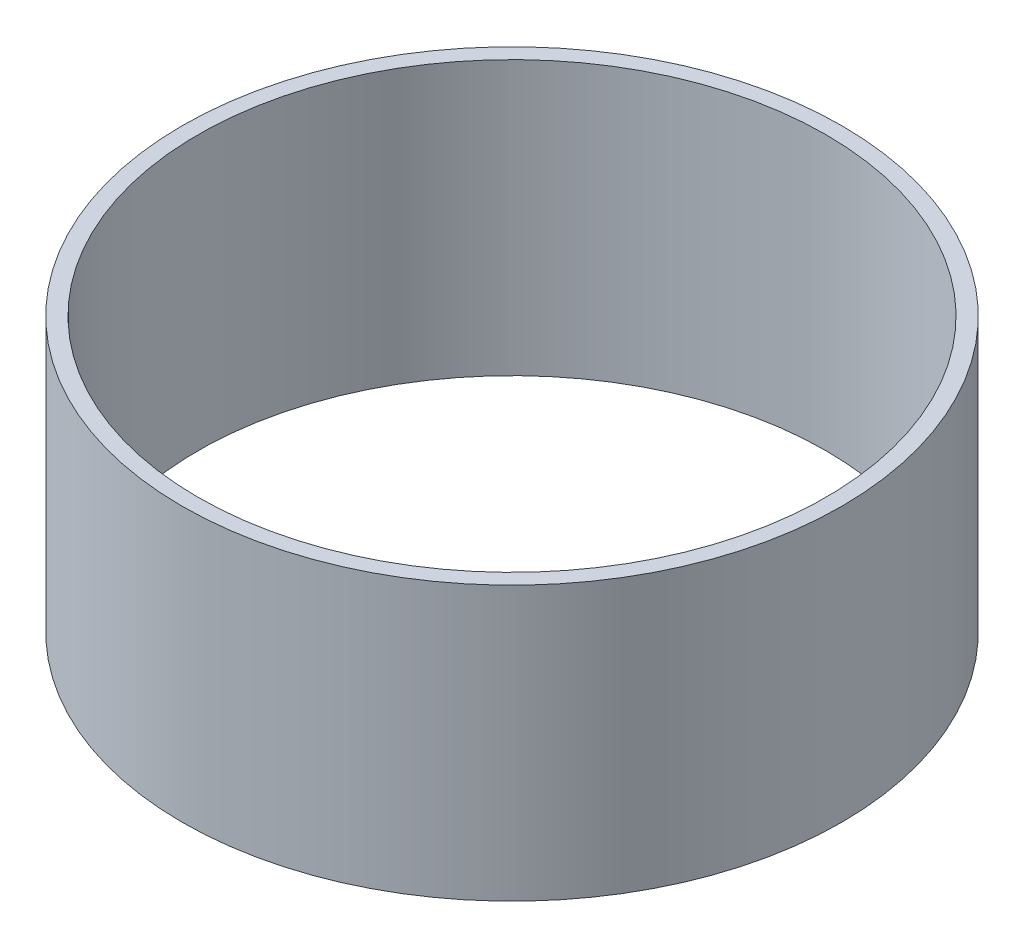
ISO-10303-21;
HEADER;
FILE_DESCRIPTION(('STEP AP214'),'2;1');
FILE_NAME('part.step','',(''),(''),'','','');
FILE_SCHEMA(('AUTOMOTIVE_DESIGN { 1 0 10303 214 1 1 1 1 }'));
ENDSEC;
DATA;
#1=APPLICATION_CONTEXT('core data for automotive mechanical design processes');
#2=APPLICATION_PROTOCOL_DEFINITION('international standard','automotive_design',2000,#1);
#3=PRODUCT_CONTEXT('',#1,'mechanical');
#4=PRODUCT('Part','Part','',(#3));
#5=PRODUCT_RELATED_PRODUCT_CATEGORY('part','',(#4));
#6=PRODUCT_DEFINITION_FORMATION('','',#4);
#7=PRODUCT_DEFINITION_CONTEXT('part definition',#1,'design');
#8=PRODUCT_DEFINITION('design','',#6,#7);
#9=PRODUCT_DEFINITION_SHAPE('','',#8);
#10=(LENGTH_UNIT() NAMED_UNIT(*) SI_UNIT(.MILLI.,.METRE.));
#11=(NAMED_UNIT(*) PLANE_ANGLE_UNIT() SI_UNIT($,.RADIAN.));
#12=(NAMED_UNIT(*) SI_UNIT($,.STERADIAN.) SOLID_ANGLE_UNIT());
#13=UNCERTAINTY_MEASURE_WITH_UNIT(LENGTH_MEASURE(1.E-05),#10,'distance_accuracy_value','');
#14=(GEOMETRIC_REPRESENTATION_CONTEXT(3) GLOBAL_UNCERTAINTY_ASSIGNED_CONTEXT((#13)) GLOBAL_UNIT_ASSIGNED_CONTEXT((#10,
#11,#12)) REPRESENTATION_CONTEXT('',''));
#15=CARTESIAN_POINT('',(0.,0.,0.));
#16=DIRECTION('',(0.,0.,1.));
#17=DIRECTION('',(1.,0.,0.));
#18=AXIS2_PLACEMENT_3D('',#15,#16,#17);
#19=CARTESIAN_POINT('',(0.,52.3,0.));
#20=DIRECTION('',(0.,-1.,0.));
#21=DIRECTION('',(0.,0.,-1.));
#22=AXIS2_PLACEMENT_3D('',#19,#20,#21);
#23=CYLINDRICAL_SURFACE('',#22,63.);
#24=CARTESIAN_POINT('',(0.,52.3,0.));
#25=DIRECTION('',(0.,1.,0.));
#26=DIRECTION('',(0.,0.,1.));
#27=AXIS2_PLACEMENT_3D('',#24,#25,#26);
#28=CIRCLE('',#27,63.);
#29=CARTESIAN_POINT('',(0.,52.3,63.));
#30=VERTEX_POINT('',#29);
#31=EDGE_CURVE('E10',#30,#30,#28,.T.);
#32=ORIENTED_EDGE('',*,*,#31,.F.);
#33=EDGE_LOOP('',(#32));
#34=FACE_BOUND('',#33,.T.);
#35=CARTESIAN_POINT('',(0.,0.,0.));
#36=DIRECTION('',(0.,1.,0.));
#37=DIRECTION('',(0.,0.,1.));
#38=AXIS2_PLACEMENT_3D('',#35,#36,#37);
#39=CIRCLE('',#38,63.);
#40=CARTESIAN_POINT('',(0.,0.,63.));
#41=VERTEX_POINT('',#40);
#42=EDGE_CURVE('E37',#41,#41,#39,.T.);
#43=ORIENTED_EDGE('',*,*,#42,.T.);
#44=EDGE_LOOP('',(#43));
#45=FACE_BOUND('',#44,.T.);
#46=ADVANCED_FACE('F34',(#34,#45),#23,.T.);
#47=CARTESIAN_POINT('',(0.,52.3,0.));
#48=DIRECTION('',(0.,1.,0.));
#49=DIRECTION('',(0.,0.,1.));
#50=AXIS2_PLACEMENT_3D('',#47,#48,#49);
#51=PLANE('',#50);
#52=CARTESIAN_POINT('',(0.,52.3,0.));
#53=DIRECTION('',(0.,1.,0.));
#54=DIRECTION('',(0.,0.,1.));
#55=AXIS2_PLACEMENT_3D('',#52,#53,#54);
#56=CIRCLE('',#55,60.);
#57=CARTESIAN_POINT('',(0.,52.3,60.));
#58=VERTEX_POINT('',#57);
#59=EDGE_CURVE('E46',#58,#58,#56,.T.);
#60=ORIENTED_EDGE('',*,*,#59,.F.);
#61=EDGE_LOOP('',(#60));
#62=FACE_BOUND('',#61,.T.);
#63=ORIENTED_EDGE('',*,*,#31,.T.);
#64=EDGE_LOOP('',(#63));
#65=FACE_BOUND('',#64,.T.);
#66=ADVANCED_FACE('F61',(#62,#65),#51,.T.);
#67=CARTESIAN_POINT('',(0.,0.,0.));
#68=DIRECTION('',(0.,1.,0.));
#69=DIRECTION('',(0.,0.,1.));
#70=AXIS2_PLACEMENT_3D('',#67,#68,#69);
#71=PLANE('',#70);
#72=CARTESIAN_POINT('',(0.,0.,0.));
#73=DIRECTION('',(0.,1.,0.));
#74=DIRECTION('',(0.,0.,1.));
#75=AXIS2_PLACEMENT_3D('',#72,#73,#74);
#76=CIRCLE('',#75,60.);
#77=CARTESIAN_POINT('',(0.,0.,60.));
#78=VERTEX_POINT('',#77);
#79=EDGE_CURVE('E44',#78,#78,#76,.T.);
#80=ORIENTED_EDGE('',*,*,#79,.T.);
#81=EDGE_LOOP('',(#80));
#82=FACE_BOUND('',#81,.T.);
#83=ORIENTED_EDGE('',*,*,#42,.F.);
#84=EDGE_LOOP('',(#83));
#85=FACE_BOUND('',#84,.T.);
#86=ADVANCED_FACE('F52',(#82,#85),#71,.F.);
#87=CARTESIAN_POINT('',(0.,0.,0.));
#88=DIRECTION('',(0.,1.,0.));
#89=DIRECTION('',(0.,0.,1.));
#90=AXIS2_PLACEMENT_3D('',#87,#88,#89);
#91=CYLINDRICAL_SURFACE('',#90,60.);
#92=ORIENTED_EDGE('',*,*,#79,.F.);
#93=EDGE_LOOP('',(#92));
#94=FACE_BOUND('',#93,.T.);
#95=ORIENTED_EDGE('',*,*,#59,.T.);
#96=EDGE_LOOP('',(#95));
#97=FACE_BOUND('',#96,.T.);
#98=ADVANCED_FACE('F55',(#94,#97),#91,.F.);
#99=CLOSED_SHELL('',(#46,#66,#86,#98));
#100=MANIFOLD_SOLID_BREP('B2',#99);
#101=ADVANCED_BREP_SHAPE_REPRESENTATION('',(#18,#100),#14);
#102=SHAPE_DEFINITION_REPRESENTATION(#9,#101);
ENDSEC;
END-ISO-10303-21;
